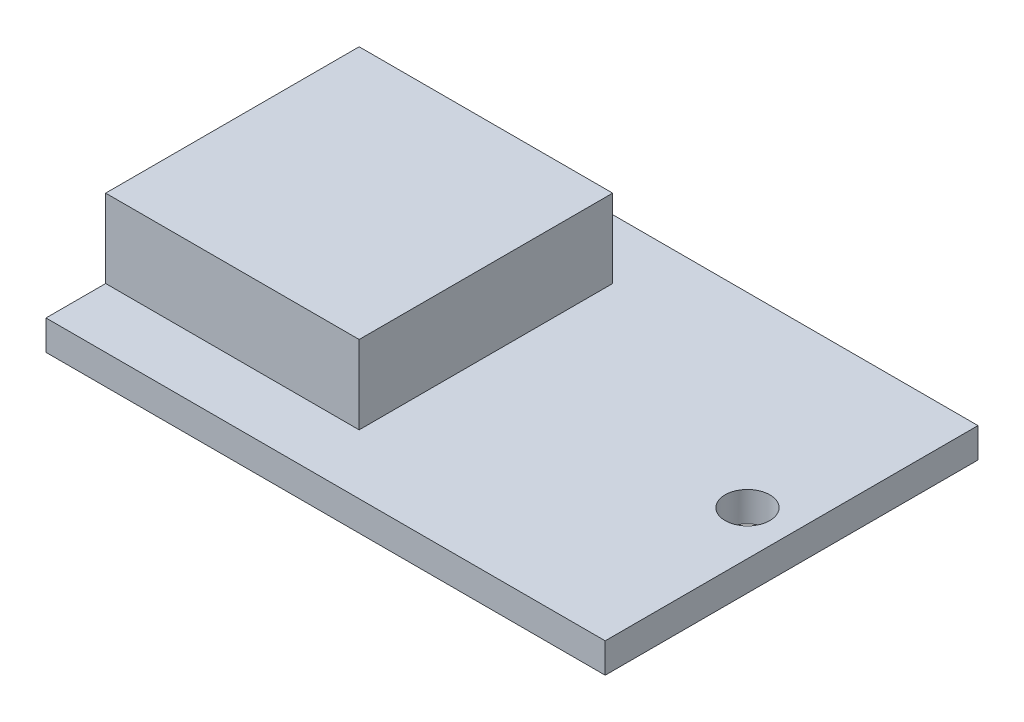
ISO-10303-21;
HEADER;
FILE_DESCRIPTION(('STEP AP214'),'2;1');
FILE_NAME('part.step','',(''),(''),'','','');
FILE_SCHEMA(('AUTOMOTIVE_DESIGN { 1 0 10303 214 1 1 1 1 }'));
ENDSEC;
DATA;
#1=APPLICATION_CONTEXT('core data for automotive mechanical design processes');
#2=APPLICATION_PROTOCOL_DEFINITION('international standard','automotive_design',2000,#1);
#3=PRODUCT_CONTEXT('',#1,'mechanical');
#4=PRODUCT('Part','Part','',(#3));
#5=PRODUCT_RELATED_PRODUCT_CATEGORY('part','',(#4));
#6=PRODUCT_DEFINITION_FORMATION('','',#4);
#7=PRODUCT_DEFINITION_CONTEXT('part definition',#1,'design');
#8=PRODUCT_DEFINITION('design','',#6,#7);
#9=PRODUCT_DEFINITION_SHAPE('','',#8);
#10=(LENGTH_UNIT() NAMED_UNIT(*) SI_UNIT(.MILLI.,.METRE.));
#11=(NAMED_UNIT(*) PLANE_ANGLE_UNIT() SI_UNIT($,.RADIAN.));
#12=(NAMED_UNIT(*) SI_UNIT($,.STERADIAN.) SOLID_ANGLE_UNIT());
#13=UNCERTAINTY_MEASURE_WITH_UNIT(LENGTH_MEASURE(1.E-05),#10,'distance_accuracy_value','');
#14=(GEOMETRIC_REPRESENTATION_CONTEXT(3) GLOBAL_UNCERTAINTY_ASSIGNED_CONTEXT((#13)) GLOBAL_UNIT_ASSIGNED_CONTEXT((#10,
#11,#12)) REPRESENTATION_CONTEXT('',''));
#15=CARTESIAN_POINT('',(0.,0.,0.));
#16=DIRECTION('',(0.,0.,1.));
#17=DIRECTION('',(1.,0.,0.));
#18=AXIS2_PLACEMENT_3D('',#15,#16,#17);
#19=CARTESIAN_POINT('',(0.,4.,0.));
#20=DIRECTION('',(0.,-1.,0.));
#21=DIRECTION('',(0.,0.,-1.));
#22=AXIS2_PLACEMENT_3D('',#19,#20,#21);
#23=PLANE('',#22);
#24=CARTESIAN_POINT('',(69.0789862758002,4.,0.));
#25=DIRECTION('',(0.,1.,0.));
#26=DIRECTION('',(0.,0.,1.));
#27=AXIS2_PLACEMENT_3D('',#24,#25,#26);
#28=CIRCLE('',#27,3.00000000000001);
#29=CARTESIAN_POINT('',(69.0789862758002,4.,3.00000000000001));
#30=VERTEX_POINT('',#29);
#31=EDGE_CURVE('E283',#30,#30,#28,.T.);
#32=ORIENTED_EDGE('',*,*,#31,.F.);
#33=EDGE_LOOP('',(#32));
#34=FACE_BOUND('',#33,.T.);
#35=DIRECTION('',(1.,0.,0.));
#36=VECTOR('',#35,1.);
#37=CARTESIAN_POINT('',(34.,4.,17.));
#38=LINE('',#37,#36);
#39=CARTESIAN_POINT('',(0.,4.,17.));
#40=VERTEX_POINT('',#39);
#41=CARTESIAN_POINT('',(34.,4.,17.));
#42=VERTEX_POINT('',#41);
#43=EDGE_CURVE('E59',#40,#42,#38,.T.);
#44=ORIENTED_EDGE('',*,*,#43,.F.);
#45=DIRECTION('',(0.,0.,1.));
#46=VECTOR('',#45,1.);
#47=CARTESIAN_POINT('',(0.,4.,25.));
#48=LINE('',#47,#46);
#49=CARTESIAN_POINT('',(0.,4.,25.));
#50=VERTEX_POINT('',#49);
#51=EDGE_CURVE('E126',#40,#50,#48,.T.);
#52=ORIENTED_EDGE('',*,*,#51,.T.);
#53=DIRECTION('',(1.,0.,0.));
#54=VECTOR('',#53,1.);
#55=CARTESIAN_POINT('',(75.,4.,25.));
#56=LINE('',#55,#54);
#57=CARTESIAN_POINT('',(75.,4.,25.));
#58=VERTEX_POINT('',#57);
#59=EDGE_CURVE('E137',#50,#58,#56,.T.);
#60=ORIENTED_EDGE('',*,*,#59,.T.);
#61=DIRECTION('',(0.,0.,-1.));
#62=VECTOR('',#61,1.);
#63=CARTESIAN_POINT('',(75.,4.,-25.));
#64=LINE('',#63,#62);
#65=CARTESIAN_POINT('',(75.,4.,-25.));
#66=VERTEX_POINT('',#65);
#67=EDGE_CURVE('E139',#58,#66,#64,.T.);
#68=ORIENTED_EDGE('',*,*,#67,.T.);
#69=DIRECTION('',(-1.,0.,0.));
#70=VECTOR('',#69,1.);
#71=CARTESIAN_POINT('',(0.,4.,-25.));
#72=LINE('',#71,#70);
#73=CARTESIAN_POINT('',(0.,4.,-25.));
#74=VERTEX_POINT('',#73);
#75=EDGE_CURVE('E141',#66,#74,#72,.T.);
#76=ORIENTED_EDGE('',*,*,#75,.T.);
#77=CARTESIAN_POINT('',(0.,4.,-17.));
#78=VERTEX_POINT('',#77);
#79=EDGE_CURVE('E135',#74,#78,#48,.T.);
#80=ORIENTED_EDGE('',*,*,#79,.T.);
#81=DIRECTION('',(-1.,0.,0.));
#82=VECTOR('',#81,1.);
#83=CARTESIAN_POINT('',(0.,4.,-17.));
#84=LINE('',#83,#82);
#85=CARTESIAN_POINT('',(34.,4.,-17.));
#86=VERTEX_POINT('',#85);
#87=EDGE_CURVE('E122',#86,#78,#84,.T.);
#88=ORIENTED_EDGE('',*,*,#87,.F.);
#89=DIRECTION('',(0.,0.,-1.));
#90=VECTOR('',#89,1.);
#91=CARTESIAN_POINT('',(34.,4.,-17.));
#92=LINE('',#91,#90);
#93=EDGE_CURVE('E55',#42,#86,#92,.T.);
#94=ORIENTED_EDGE('',*,*,#93,.F.);
#95=EDGE_LOOP('',(#44,#52,#60,#68,#76,#80,#88,#94));
#96=FACE_BOUND('',#95,.T.);
#97=ADVANCED_FACE('F39',(#34,#96),#23,.F.);
#98=CARTESIAN_POINT('',(75.,4.,25.));
#99=DIRECTION('',(0.,0.,-1.));
#100=DIRECTION('',(-1.,0.,0.));
#101=AXIS2_PLACEMENT_3D('',#98,#99,#100);
#102=PLANE('',#101);
#103=DIRECTION('',(1.,0.,0.));
#104=VECTOR('',#103,1.);
#105=CARTESIAN_POINT('',(75.,0.,25.));
#106=LINE('',#105,#104);
#107=CARTESIAN_POINT('',(0.,0.,25.));
#108=VERTEX_POINT('',#107);
#109=CARTESIAN_POINT('',(75.,0.,25.));
#110=VERTEX_POINT('',#109);
#111=EDGE_CURVE('E127',#108,#110,#106,.T.);
#112=ORIENTED_EDGE('',*,*,#111,.T.);
#113=DIRECTION('',(0.,-1.,0.));
#114=VECTOR('',#113,1.);
#115=CARTESIAN_POINT('',(75.,4.,25.));
#116=LINE('',#115,#114);
#117=EDGE_CURVE('E48',#58,#110,#116,.T.);
#118=ORIENTED_EDGE('',*,*,#117,.F.);
#119=ORIENTED_EDGE('',*,*,#59,.F.);
#120=DIRECTION('',(0.,-1.,0.));
#121=VECTOR('',#120,1.);
#122=CARTESIAN_POINT('',(0.,4.,25.));
#123=LINE('',#122,#121);
#124=EDGE_CURVE('E11',#50,#108,#123,.T.);
#125=ORIENTED_EDGE('',*,*,#124,.T.);
#126=EDGE_LOOP('',(#112,#118,#119,#125));
#127=FACE_BOUND('',#126,.T.);
#128=ADVANCED_FACE('F41',(#127),#102,.F.);
#129=CARTESIAN_POINT('',(75.,4.,-25.));
#130=DIRECTION('',(-1.,0.,0.));
#131=DIRECTION('',(0.,0.,1.));
#132=AXIS2_PLACEMENT_3D('',#129,#130,#131);
#133=PLANE('',#132);
#134=DIRECTION('',(0.,0.,-1.));
#135=VECTOR('',#134,1.);
#136=CARTESIAN_POINT('',(75.,0.,-25.));
#137=LINE('',#136,#135);
#138=CARTESIAN_POINT('',(75.,0.,-25.));
#139=VERTEX_POINT('',#138);
#140=EDGE_CURVE('E129',#110,#139,#137,.T.);
#141=ORIENTED_EDGE('',*,*,#140,.T.);
#142=DIRECTION('',(0.,-1.,0.));
#143=VECTOR('',#142,1.);
#144=CARTESIAN_POINT('',(75.,4.,-25.));
#145=LINE('',#144,#143);
#146=EDGE_CURVE('E152',#66,#139,#145,.T.);
#147=ORIENTED_EDGE('',*,*,#146,.F.);
#148=ORIENTED_EDGE('',*,*,#67,.F.);
#149=ORIENTED_EDGE('',*,*,#117,.T.);
#150=EDGE_LOOP('',(#141,#147,#148,#149));
#151=FACE_BOUND('',#150,.T.);
#152=ADVANCED_FACE('F160',(#151),#133,.F.);
#153=CARTESIAN_POINT('',(0.,4.,-25.));
#154=DIRECTION('',(0.,0.,1.));
#155=DIRECTION('',(1.,0.,0.));
#156=AXIS2_PLACEMENT_3D('',#153,#154,#155);
#157=PLANE('',#156);
#158=DIRECTION('',(-1.,0.,0.));
#159=VECTOR('',#158,1.);
#160=CARTESIAN_POINT('',(0.,0.,-25.));
#161=LINE('',#160,#159);
#162=CARTESIAN_POINT('',(0.,0.,-25.));
#163=VERTEX_POINT('',#162);
#164=EDGE_CURVE('E146',#139,#163,#161,.T.);
#165=ORIENTED_EDGE('',*,*,#164,.T.);
#166=DIRECTION('',(0.,-1.,0.));
#167=VECTOR('',#166,1.);
#168=CARTESIAN_POINT('',(0.,4.,-25.));
#169=LINE('',#168,#167);
#170=EDGE_CURVE('E143',#74,#163,#169,.T.);
#171=ORIENTED_EDGE('',*,*,#170,.F.);
#172=ORIENTED_EDGE('',*,*,#75,.F.);
#173=ORIENTED_EDGE('',*,*,#146,.T.);
#174=EDGE_LOOP('',(#165,#171,#172,#173));
#175=FACE_BOUND('',#174,.T.);
#176=ADVANCED_FACE('F171',(#175),#157,.F.);
#177=CARTESIAN_POINT('',(0.,4.,0.));
#178=DIRECTION('',(1.,0.,0.));
#179=DIRECTION('',(0.,0.,-1.));
#180=AXIS2_PLACEMENT_3D('',#177,#178,#179);
#181=PLANE('',#180);
#182=DIRECTION('',(0.,0.,1.));
#183=VECTOR('',#182,1.);
#184=CARTESIAN_POINT('',(0.,0.,0.));
#185=LINE('',#184,#183);
#186=EDGE_CURVE('E148',#163,#108,#185,.T.);
#187=ORIENTED_EDGE('',*,*,#186,.T.);
#188=ORIENTED_EDGE('',*,*,#124,.F.);
#189=ORIENTED_EDGE('',*,*,#51,.F.);
#190=DIRECTION('',(0.,-1.,0.));
#191=VECTOR('',#190,1.);
#192=CARTESIAN_POINT('',(0.,14.5,17.));
#193=LINE('',#192,#191);
#194=CARTESIAN_POINT('',(0.,14.5,17.));
#195=VERTEX_POINT('',#194);
#196=EDGE_CURVE('E107',#195,#40,#193,.T.);
#197=ORIENTED_EDGE('',*,*,#196,.F.);
#198=DIRECTION('',(0.,0.,1.));
#199=VECTOR('',#198,1.);
#200=CARTESIAN_POINT('',(0.,14.5,17.));
#201=LINE('',#200,#199);
#202=CARTESIAN_POINT('',(0.,14.5,-17.));
#203=VERTEX_POINT('',#202);
#204=EDGE_CURVE('E113',#203,#195,#201,.T.);
#205=ORIENTED_EDGE('',*,*,#204,.F.);
#206=DIRECTION('',(0.,-1.,0.));
#207=VECTOR('',#206,1.);
#208=CARTESIAN_POINT('',(0.,14.5,-17.));
#209=LINE('',#208,#207);
#210=EDGE_CURVE('E173',#203,#78,#209,.T.);
#211=ORIENTED_EDGE('',*,*,#210,.T.);
#212=ORIENTED_EDGE('',*,*,#79,.F.);
#213=ORIENTED_EDGE('',*,*,#170,.T.);
#214=EDGE_LOOP('',(#187,#188,#189,#197,#205,#211,#212,#213));
#215=FACE_BOUND('',#214,.T.);
#216=ADVANCED_FACE('F124',(#215),#181,.F.);
#217=CARTESIAN_POINT('',(0.,0.,0.));
#218=DIRECTION('',(0.,-1.,0.));
#219=DIRECTION('',(0.,0.,-1.));
#220=AXIS2_PLACEMENT_3D('',#217,#218,#219);
#221=PLANE('',#220);
#222=CARTESIAN_POINT('',(69.0789862758002,0.,0.));
#223=DIRECTION('',(0.,-1.,0.));
#224=DIRECTION('',(0.,0.,-1.));
#225=AXIS2_PLACEMENT_3D('',#222,#223,#224);
#226=CIRCLE('',#225,3.00000000000001);
#227=CARTESIAN_POINT('',(69.0789862758002,0.,-3.00000000000001));
#228=VERTEX_POINT('',#227);
#229=EDGE_CURVE('E43',#228,#228,#226,.T.);
#230=ORIENTED_EDGE('',*,*,#229,.F.);
#231=EDGE_LOOP('',(#230));
#232=FACE_BOUND('',#231,.T.);
#233=ORIENTED_EDGE('',*,*,#111,.F.);
#234=ORIENTED_EDGE('',*,*,#186,.F.);
#235=ORIENTED_EDGE('',*,*,#164,.F.);
#236=ORIENTED_EDGE('',*,*,#140,.F.);
#237=EDGE_LOOP('',(#233,#234,#235,#236));
#238=FACE_BOUND('',#237,.T.);
#239=ADVANCED_FACE('F167',(#232,#238),#221,.T.);
#240=CARTESIAN_POINT('',(34.,14.5,17.));
#241=DIRECTION('',(0.,0.,-1.));
#242=DIRECTION('',(-1.,0.,0.));
#243=AXIS2_PLACEMENT_3D('',#240,#241,#242);
#244=PLANE('',#243);
#245=ORIENTED_EDGE('',*,*,#43,.T.);
#246=DIRECTION('',(0.,-1.,0.));
#247=VECTOR('',#246,1.);
#248=CARTESIAN_POINT('',(34.,14.5,17.));
#249=LINE('',#248,#247);
#250=CARTESIAN_POINT('',(34.,14.5,17.));
#251=VERTEX_POINT('',#250);
#252=EDGE_CURVE('E109',#251,#42,#249,.T.);
#253=ORIENTED_EDGE('',*,*,#252,.F.);
#254=DIRECTION('',(1.,0.,0.));
#255=VECTOR('',#254,1.);
#256=CARTESIAN_POINT('',(34.,14.5,17.));
#257=LINE('',#256,#255);
#258=EDGE_CURVE('E103',#195,#251,#257,.T.);
#259=ORIENTED_EDGE('',*,*,#258,.F.);
#260=ORIENTED_EDGE('',*,*,#196,.T.);
#261=EDGE_LOOP('',(#245,#253,#259,#260));
#262=FACE_BOUND('',#261,.T.);
#263=ADVANCED_FACE('F105',(#262),#244,.F.);
#264=CARTESIAN_POINT('',(34.,14.5,-17.));
#265=DIRECTION('',(-1.,0.,0.));
#266=DIRECTION('',(0.,0.,1.));
#267=AXIS2_PLACEMENT_3D('',#264,#265,#266);
#268=PLANE('',#267);
#269=ORIENTED_EDGE('',*,*,#93,.T.);
#270=DIRECTION('',(0.,-1.,0.));
#271=VECTOR('',#270,1.);
#272=CARTESIAN_POINT('',(34.,14.5,-17.));
#273=LINE('',#272,#271);
#274=CARTESIAN_POINT('',(34.,14.5,-17.));
#275=VERTEX_POINT('',#274);
#276=EDGE_CURVE('E131',#275,#86,#273,.T.);
#277=ORIENTED_EDGE('',*,*,#276,.F.);
#278=DIRECTION('',(0.,0.,-1.));
#279=VECTOR('',#278,1.);
#280=CARTESIAN_POINT('',(34.,14.5,-17.));
#281=LINE('',#280,#279);
#282=EDGE_CURVE('E112',#251,#275,#281,.T.);
#283=ORIENTED_EDGE('',*,*,#282,.F.);
#284=ORIENTED_EDGE('',*,*,#252,.T.);
#285=EDGE_LOOP('',(#269,#277,#283,#284));
#286=FACE_BOUND('',#285,.T.);
#287=ADVANCED_FACE('F212',(#286),#268,.F.);
#288=CARTESIAN_POINT('',(0.,14.5,-17.));
#289=DIRECTION('',(0.,0.,1.));
#290=DIRECTION('',(1.,0.,0.));
#291=AXIS2_PLACEMENT_3D('',#288,#289,#290);
#292=PLANE('',#291);
#293=ORIENTED_EDGE('',*,*,#87,.T.);
#294=ORIENTED_EDGE('',*,*,#210,.F.);
#295=DIRECTION('',(-1.,0.,0.));
#296=VECTOR('',#295,1.);
#297=CARTESIAN_POINT('',(0.,14.5,-17.));
#298=LINE('',#297,#296);
#299=EDGE_CURVE('E118',#275,#203,#298,.T.);
#300=ORIENTED_EDGE('',*,*,#299,.F.);
#301=ORIENTED_EDGE('',*,*,#276,.T.);
#302=EDGE_LOOP('',(#293,#294,#300,#301));
#303=FACE_BOUND('',#302,.T.);
#304=ADVANCED_FACE('F219',(#303),#292,.F.);
#305=CARTESIAN_POINT('',(0.,14.5,0.));
#306=DIRECTION('',(0.,-1.,0.));
#307=DIRECTION('',(0.,0.,-1.));
#308=AXIS2_PLACEMENT_3D('',#305,#306,#307);
#309=PLANE('',#308);
#310=ORIENTED_EDGE('',*,*,#204,.T.);
#311=ORIENTED_EDGE('',*,*,#258,.T.);
#312=ORIENTED_EDGE('',*,*,#282,.T.);
#313=ORIENTED_EDGE('',*,*,#299,.T.);
#314=EDGE_LOOP('',(#310,#311,#312,#313));
#315=FACE_BOUND('',#314,.T.);
#316=ADVANCED_FACE('F116',(#315),#309,.F.);
#317=CARTESIAN_POINT('',(69.0789862758002,-6.,0.));
#318=DIRECTION('',(0.,1.,0.));
#319=DIRECTION('',(0.,0.,1.));
#320=AXIS2_PLACEMENT_3D('',#317,#318,#319);
#321=CYLINDRICAL_SURFACE('',#320,3.00000000000001);
#322=ORIENTED_EDGE('',*,*,#229,.T.);
#323=EDGE_LOOP('',(#322));
#324=FACE_BOUND('',#323,.T.);
#325=ORIENTED_EDGE('',*,*,#31,.T.);
#326=EDGE_LOOP('',(#325));
#327=FACE_BOUND('',#326,.T.);
#328=ADVANCED_FACE('F233',(#324,#327),#321,.F.);
#329=CLOSED_SHELL('',(#97,#128,#152,#176,#216,#239,#263,#287,#304,#316,#328));
#330=MANIFOLD_SOLID_BREP('B2',#329);
#331=ADVANCED_BREP_SHAPE_REPRESENTATION('',(#18,#330),#14);
#332=SHAPE_DEFINITION_REPRESENTATION(#9,#331);
ENDSEC;
END-ISO-10303-21;
